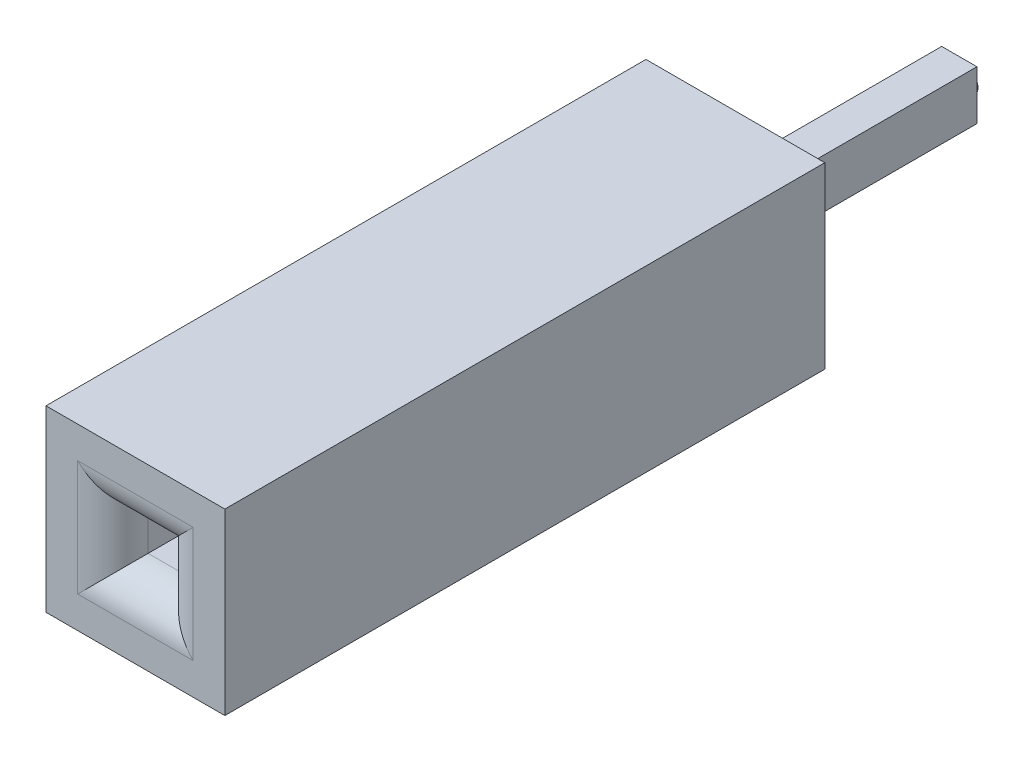
ISO-10303-21;
HEADER;
FILE_DESCRIPTION(('STEP AP214'),'2;1');
FILE_NAME('part.step','',(''),(''),'','','');
FILE_SCHEMA(('AUTOMOTIVE_DESIGN { 1 0 10303 214 1 1 1 1 }'));
ENDSEC;
DATA;
#1=APPLICATION_CONTEXT('core data for automotive mechanical design processes');
#2=APPLICATION_PROTOCOL_DEFINITION('international standard','automotive_design',2000,#1);
#3=PRODUCT_CONTEXT('',#1,'mechanical');
#4=PRODUCT('Part','Part','',(#3));
#5=PRODUCT_RELATED_PRODUCT_CATEGORY('part','',(#4));
#6=PRODUCT_DEFINITION_FORMATION('','',#4);
#7=PRODUCT_DEFINITION_CONTEXT('part definition',#1,'design');
#8=PRODUCT_DEFINITION('design','',#6,#7);
#9=PRODUCT_DEFINITION_SHAPE('','',#8);
#10=(LENGTH_UNIT() NAMED_UNIT(*) SI_UNIT(.MILLI.,.METRE.));
#11=(NAMED_UNIT(*) PLANE_ANGLE_UNIT() SI_UNIT($,.RADIAN.));
#12=(NAMED_UNIT(*) SI_UNIT($,.STERADIAN.) SOLID_ANGLE_UNIT());
#13=UNCERTAINTY_MEASURE_WITH_UNIT(LENGTH_MEASURE(1.E-05),#10,'distance_accuracy_value','');
#14=(GEOMETRIC_REPRESENTATION_CONTEXT(3) GLOBAL_UNCERTAINTY_ASSIGNED_CONTEXT((#13)) GLOBAL_UNIT_ASSIGNED_CONTEXT((#10,
#11,#12)) REPRESENTATION_CONTEXT('',''));
#15=CARTESIAN_POINT('',(0.,0.,0.));
#16=DIRECTION('',(0.,0.,1.));
#17=DIRECTION('',(1.,0.,0.));
#18=AXIS2_PLACEMENT_3D('',#15,#16,#17);
#19=CARTESIAN_POINT('',(-0.25,-0.35,-3.18));
#20=DIRECTION('',(0.,0.,-1.));
#21=DIRECTION('',(0.,1.,0.));
#22=AXIS2_PLACEMENT_3D('',#19,#20,#21);
#23=PLANE('',#22);
#24=DIRECTION('',(0.,1.,0.));
#25=VECTOR('',#24,1.);
#26=CARTESIAN_POINT('',(-0.25,0.35,-3.18));
#27=LINE('',#26,#25);
#28=CARTESIAN_POINT('',(-0.25,-0.35,-3.18));
#29=VERTEX_POINT('',#28);
#30=CARTESIAN_POINT('',(-0.25,0.35,-3.18));
#31=VERTEX_POINT('',#30);
#32=EDGE_CURVE('E146',#29,#31,#27,.T.);
#33=ORIENTED_EDGE('',*,*,#32,.T.);
#34=DIRECTION('',(1.,0.,0.));
#35=VECTOR('',#34,1.);
#36=CARTESIAN_POINT('',(0.25,0.35,-3.18));
#37=LINE('',#36,#35);
#38=CARTESIAN_POINT('',(0.25,0.35,-3.18));
#39=VERTEX_POINT('',#38);
#40=EDGE_CURVE('E135',#31,#39,#37,.T.);
#41=ORIENTED_EDGE('',*,*,#40,.T.);
#42=DIRECTION('',(0.,-1.,0.));
#43=VECTOR('',#42,1.);
#44=CARTESIAN_POINT('',(0.25,0.35,-3.18));
#45=LINE('',#44,#43);
#46=CARTESIAN_POINT('',(0.25,-0.35,-3.18));
#47=VERTEX_POINT('',#46);
#48=EDGE_CURVE('E145',#39,#47,#45,.T.);
#49=ORIENTED_EDGE('',*,*,#48,.T.);
#50=DIRECTION('',(-1.,0.,0.));
#51=VECTOR('',#50,1.);
#52=CARTESIAN_POINT('',(0.25,-0.35,-3.18));
#53=LINE('',#52,#51);
#54=EDGE_CURVE('E150',#47,#29,#53,.T.);
#55=ORIENTED_EDGE('',*,*,#54,.T.);
#56=EDGE_LOOP('',(#33,#41,#49,#55));
#57=FACE_BOUND('',#56,.T.);
#58=CARTESIAN_POINT('',(0.,0.,-3.18));
#59=DIRECTION('',(0.,0.,-1.));
#60=DIRECTION('',(0.,1.,0.));
#61=AXIS2_PLACEMENT_3D('',#58,#59,#60);
#62=CIRCLE('',#61,0.165430125999977);
#63=CARTESIAN_POINT('',(0.,0.165430125999976,-3.18));
#64=VERTEX_POINT('',#63);
#65=EDGE_CURVE('E396',#64,#64,#62,.T.);
#66=ORIENTED_EDGE('',*,*,#65,.F.);
#67=EDGE_LOOP('',(#66));
#68=FACE_BOUND('',#67,.T.);
#69=ADVANCED_FACE('F33',(#57,#68),#23,.T.);
#70=CARTESIAN_POINT('',(1.27,1.27,0.));
#71=DIRECTION('',(0.,0.,-1.));
#72=DIRECTION('',(-1.,0.,0.));
#73=AXIS2_PLACEMENT_3D('',#70,#71,#72);
#74=PLANE('',#73);
#75=DIRECTION('',(0.,1.,0.));
#76=VECTOR('',#75,1.);
#77=CARTESIAN_POINT('',(1.27,-1.27,0.));
#78=LINE('',#77,#76);
#79=CARTESIAN_POINT('',(1.27,-1.27,0.));
#80=VERTEX_POINT('',#79);
#81=CARTESIAN_POINT('',(1.27,1.27,0.));
#82=VERTEX_POINT('',#81);
#83=EDGE_CURVE('E183',#80,#82,#78,.T.);
#84=ORIENTED_EDGE('',*,*,#83,.F.);
#85=DIRECTION('',(1.,0.,0.));
#86=VECTOR('',#85,1.);
#87=CARTESIAN_POINT('',(-1.27,-1.27,0.));
#88=LINE('',#87,#86);
#89=CARTESIAN_POINT('',(-1.27,-1.27,0.));
#90=VERTEX_POINT('',#89);
#91=EDGE_CURVE('E194',#90,#80,#88,.T.);
#92=ORIENTED_EDGE('',*,*,#91,.F.);
#93=DIRECTION('',(0.,-1.,0.));
#94=VECTOR('',#93,1.);
#95=CARTESIAN_POINT('',(-1.27,-1.27,0.));
#96=LINE('',#95,#94);
#97=CARTESIAN_POINT('',(-1.27,1.27,0.));
#98=VERTEX_POINT('',#97);
#99=EDGE_CURVE('E205',#98,#90,#96,.T.);
#100=ORIENTED_EDGE('',*,*,#99,.F.);
#101=DIRECTION('',(-1.,0.,0.));
#102=VECTOR('',#101,1.);
#103=CARTESIAN_POINT('',(-1.27,1.27,0.));
#104=LINE('',#103,#102);
#105=EDGE_CURVE('E203',#82,#98,#104,.T.);
#106=ORIENTED_EDGE('',*,*,#105,.F.);
#107=EDGE_LOOP('',(#84,#92,#100,#106));
#108=FACE_BOUND('',#107,.T.);
#109=DIRECTION('',(1.,0.,0.));
#110=VECTOR('',#109,1.);
#111=CARTESIAN_POINT('',(0.25,0.35,0.));
#112=LINE('',#111,#110);
#113=CARTESIAN_POINT('',(-0.25,0.35,0.));
#114=VERTEX_POINT('',#113);
#115=CARTESIAN_POINT('',(0.25,0.35,0.));
#116=VERTEX_POINT('',#115);
#117=EDGE_CURVE('E410',#114,#116,#112,.T.);
#118=ORIENTED_EDGE('',*,*,#117,.F.);
#119=DIRECTION('',(0.,1.,0.));
#120=VECTOR('',#119,1.);
#121=CARTESIAN_POINT('',(-0.25,0.35,0.));
#122=LINE('',#121,#120);
#123=CARTESIAN_POINT('',(-0.25,-0.35,0.));
#124=VERTEX_POINT('',#123);
#125=EDGE_CURVE('E158',#124,#114,#122,.T.);
#126=ORIENTED_EDGE('',*,*,#125,.F.);
#127=DIRECTION('',(-1.,0.,0.));
#128=VECTOR('',#127,1.);
#129=CARTESIAN_POINT('',(0.25,-0.35,0.));
#130=LINE('',#129,#128);
#131=CARTESIAN_POINT('',(0.25,-0.35,0.));
#132=VERTEX_POINT('',#131);
#133=EDGE_CURVE('E154',#132,#124,#130,.T.);
#134=ORIENTED_EDGE('',*,*,#133,.F.);
#135=DIRECTION('',(0.,-1.,0.));
#136=VECTOR('',#135,1.);
#137=CARTESIAN_POINT('',(0.25,0.35,0.));
#138=LINE('',#137,#136);
#139=EDGE_CURVE('E412',#116,#132,#138,.T.);
#140=ORIENTED_EDGE('',*,*,#139,.F.);
#141=EDGE_LOOP('',(#118,#126,#134,#140));
#142=FACE_BOUND('',#141,.T.);
#143=ADVANCED_FACE('F282',(#108,#142),#74,.T.);
#144=CARTESIAN_POINT('',(1.27,-1.27,8.52));
#145=DIRECTION('',(-1.,0.,0.));
#146=DIRECTION('',(0.,0.,1.));
#147=AXIS2_PLACEMENT_3D('',#144,#145,#146);
#148=PLANE('',#147);
#149=ORIENTED_EDGE('',*,*,#83,.T.);
#150=DIRECTION('',(0.,0.,-1.));
#151=VECTOR('',#150,1.);
#152=CARTESIAN_POINT('',(1.27,1.27,8.52));
#153=LINE('',#152,#151);
#154=CARTESIAN_POINT('',(1.27,1.27,8.52));
#155=VERTEX_POINT('',#154);
#156=EDGE_CURVE('E216',#155,#82,#153,.T.);
#157=ORIENTED_EDGE('',*,*,#156,.F.);
#158=DIRECTION('',(0.,1.,0.));
#159=VECTOR('',#158,1.);
#160=CARTESIAN_POINT('',(1.27,-1.27,8.52));
#161=LINE('',#160,#159);
#162=CARTESIAN_POINT('',(1.27,-1.27,8.52));
#163=VERTEX_POINT('',#162);
#164=EDGE_CURVE('E190',#163,#155,#161,.T.);
#165=ORIENTED_EDGE('',*,*,#164,.F.);
#166=DIRECTION('',(0.,0.,-1.));
#167=VECTOR('',#166,1.);
#168=CARTESIAN_POINT('',(1.27,-1.27,8.52));
#169=LINE('',#168,#167);
#170=EDGE_CURVE('E200',#163,#80,#169,.T.);
#171=ORIENTED_EDGE('',*,*,#170,.T.);
#172=EDGE_LOOP('',(#149,#157,#165,#171));
#173=FACE_BOUND('',#172,.T.);
#174=ADVANCED_FACE('F289',(#173),#148,.F.);
#175=CARTESIAN_POINT('',(-1.27,1.27,8.52));
#176=DIRECTION('',(0.,-1.,0.));
#177=DIRECTION('',(0.,0.,-1.));
#178=AXIS2_PLACEMENT_3D('',#175,#176,#177);
#179=PLANE('',#178);
#180=ORIENTED_EDGE('',*,*,#105,.T.);
#181=DIRECTION('',(0.,0.,-1.));
#182=VECTOR('',#181,1.);
#183=CARTESIAN_POINT('',(-1.27,1.27,8.52));
#184=LINE('',#183,#182);
#185=CARTESIAN_POINT('',(-1.27,1.27,8.52));
#186=VERTEX_POINT('',#185);
#187=EDGE_CURVE('E213',#186,#98,#184,.T.);
#188=ORIENTED_EDGE('',*,*,#187,.F.);
#189=DIRECTION('',(-1.,0.,0.));
#190=VECTOR('',#189,1.);
#191=CARTESIAN_POINT('',(-1.27,1.27,8.52));
#192=LINE('',#191,#190);
#193=EDGE_CURVE('E193',#155,#186,#192,.T.);
#194=ORIENTED_EDGE('',*,*,#193,.F.);
#195=ORIENTED_EDGE('',*,*,#156,.T.);
#196=EDGE_LOOP('',(#180,#188,#194,#195));
#197=FACE_BOUND('',#196,.T.);
#198=ADVANCED_FACE('F323',(#197),#179,.F.);
#199=CARTESIAN_POINT('',(-1.27,-1.27,8.52));
#200=DIRECTION('',(1.,0.,0.));
#201=DIRECTION('',(0.,0.,-1.));
#202=AXIS2_PLACEMENT_3D('',#199,#200,#201);
#203=PLANE('',#202);
#204=ORIENTED_EDGE('',*,*,#99,.T.);
#205=DIRECTION('',(0.,0.,-1.));
#206=VECTOR('',#205,1.);
#207=CARTESIAN_POINT('',(-1.27,-1.27,8.52));
#208=LINE('',#207,#206);
#209=CARTESIAN_POINT('',(-1.27,-1.27,8.52));
#210=VERTEX_POINT('',#209);
#211=EDGE_CURVE('E210',#210,#90,#208,.T.);
#212=ORIENTED_EDGE('',*,*,#211,.F.);
#213=DIRECTION('',(0.,-1.,0.));
#214=VECTOR('',#213,1.);
#215=CARTESIAN_POINT('',(-1.27,-1.27,8.52));
#216=LINE('',#215,#214);
#217=EDGE_CURVE('E196',#186,#210,#216,.T.);
#218=ORIENTED_EDGE('',*,*,#217,.F.);
#219=ORIENTED_EDGE('',*,*,#187,.T.);
#220=EDGE_LOOP('',(#204,#212,#218,#219));
#221=FACE_BOUND('',#220,.T.);
#222=ADVANCED_FACE('F319',(#221),#203,.F.);
#223=CARTESIAN_POINT('',(-1.27,-1.27,8.52));
#224=DIRECTION('',(0.,1.,0.));
#225=DIRECTION('',(0.,0.,1.));
#226=AXIS2_PLACEMENT_3D('',#223,#224,#225);
#227=PLANE('',#226);
#228=ORIENTED_EDGE('',*,*,#91,.T.);
#229=ORIENTED_EDGE('',*,*,#170,.F.);
#230=DIRECTION('',(1.,0.,0.));
#231=VECTOR('',#230,1.);
#232=CARTESIAN_POINT('',(-1.27,-1.27,8.52));
#233=LINE('',#232,#231);
#234=EDGE_CURVE('E198',#210,#163,#233,.T.);
#235=ORIENTED_EDGE('',*,*,#234,.F.);
#236=ORIENTED_EDGE('',*,*,#211,.T.);
#237=EDGE_LOOP('',(#228,#229,#235,#236));
#238=FACE_BOUND('',#237,.T.);
#239=ADVANCED_FACE('F314',(#238),#227,.F.);
#240=CARTESIAN_POINT('',(1.27,1.27,8.52));
#241=DIRECTION('',(0.,0.,-1.));
#242=DIRECTION('',(-1.,0.,0.));
#243=AXIS2_PLACEMENT_3D('',#240,#241,#242);
#244=PLANE('',#243);
#245=DIRECTION('',(0.,1.,0.));
#246=VECTOR('',#245,1.);
#247=CARTESIAN_POINT('',(0.82,1.27,8.52));
#248=LINE('',#247,#246);
#249=CARTESIAN_POINT('',(0.82,0.82,8.52));
#250=VERTEX_POINT('',#249);
#251=CARTESIAN_POINT('',(0.82,-0.820000000000001,8.52));
#252=VERTEX_POINT('',#251);
#253=EDGE_CURVE('E226',#250,#252,#248,.F.);
#254=ORIENTED_EDGE('',*,*,#253,.T.);
#255=DIRECTION('',(1.,0.,0.));
#256=VECTOR('',#255,1.);
#257=CARTESIAN_POINT('',(1.27,-0.82,8.52));
#258=LINE('',#257,#256);
#259=CARTESIAN_POINT('',(-0.82,-0.820000000000001,8.52));
#260=VERTEX_POINT('',#259);
#261=EDGE_CURVE('E228',#252,#260,#258,.F.);
#262=ORIENTED_EDGE('',*,*,#261,.T.);
#263=DIRECTION('',(0.,-1.,0.));
#264=VECTOR('',#263,1.);
#265=CARTESIAN_POINT('',(-0.82,1.27,8.52));
#266=LINE('',#265,#264);
#267=CARTESIAN_POINT('',(-0.82,0.82,8.52));
#268=VERTEX_POINT('',#267);
#269=EDGE_CURVE('E222',#260,#268,#266,.F.);
#270=ORIENTED_EDGE('',*,*,#269,.T.);
#271=DIRECTION('',(-1.,0.,0.));
#272=VECTOR('',#271,1.);
#273=CARTESIAN_POINT('',(1.27,0.82,8.52));
#274=LINE('',#273,#272);
#275=EDGE_CURVE('E224',#268,#250,#274,.F.);
#276=ORIENTED_EDGE('',*,*,#275,.T.);
#277=EDGE_LOOP('',(#254,#262,#270,#276));
#278=FACE_BOUND('',#277,.T.);
#279=ORIENTED_EDGE('',*,*,#164,.T.);
#280=ORIENTED_EDGE('',*,*,#193,.T.);
#281=ORIENTED_EDGE('',*,*,#217,.T.);
#282=ORIENTED_EDGE('',*,*,#234,.T.);
#283=EDGE_LOOP('',(#279,#280,#281,#282));
#284=FACE_BOUND('',#283,.T.);
#285=ADVANCED_FACE('F250',(#278,#284),#244,.F.);
#286=CARTESIAN_POINT('',(0.32,-0.320000000000001,2.02));
#287=DIRECTION('',(1.,0.,0.));
#288=DIRECTION('',(0.,0.,-1.));
#289=AXIS2_PLACEMENT_3D('',#286,#287,#288);
#290=PLANE('',#289);
#291=DIRECTION('',(0.,0.,1.));
#292=VECTOR('',#291,1.);
#293=CARTESIAN_POINT('',(0.32,-0.320000000000001,2.02));
#294=LINE('',#293,#292);
#295=CARTESIAN_POINT('',(0.32,-0.320000000000001,2.02));
#296=VERTEX_POINT('',#295);
#297=CARTESIAN_POINT('',(0.32,-0.320000000000001,8.02));
#298=VERTEX_POINT('',#297);
#299=EDGE_CURVE('E180',#296,#298,#294,.T.);
#300=ORIENTED_EDGE('',*,*,#299,.T.);
#301=DIRECTION('',(0.,1.,0.));
#302=VECTOR('',#301,1.);
#303=CARTESIAN_POINT('',(0.32,-0.320000000000001,8.02));
#304=LINE('',#303,#302);
#305=CARTESIAN_POINT('',(0.32,0.32,8.02));
#306=VERTEX_POINT('',#305);
#307=EDGE_CURVE('E231',#298,#306,#304,.T.);
#308=ORIENTED_EDGE('',*,*,#307,.T.);
#309=DIRECTION('',(0.,0.,1.));
#310=VECTOR('',#309,1.);
#311=CARTESIAN_POINT('',(0.32,0.32,2.02));
#312=LINE('',#311,#310);
#313=CARTESIAN_POINT('',(0.32,0.32,2.02));
#314=VERTEX_POINT('',#313);
#315=EDGE_CURVE('E179',#314,#306,#312,.T.);
#316=ORIENTED_EDGE('',*,*,#315,.F.);
#317=DIRECTION('',(0.,1.,0.));
#318=VECTOR('',#317,1.);
#319=CARTESIAN_POINT('',(0.32,-0.320000000000001,2.02));
#320=LINE('',#319,#318);
#321=EDGE_CURVE('E167',#296,#314,#320,.T.);
#322=ORIENTED_EDGE('',*,*,#321,.F.);
#323=EDGE_LOOP('',(#300,#308,#316,#322));
#324=FACE_BOUND('',#323,.T.);
#325=ADVANCED_FACE('F263',(#324),#290,.F.);
#326=CARTESIAN_POINT('',(-0.32,-0.320000000000001,2.02));
#327=DIRECTION('',(0.,-1.,0.));
#328=DIRECTION('',(0.,0.,-1.));
#329=AXIS2_PLACEMENT_3D('',#326,#327,#328);
#330=PLANE('',#329);
#331=DIRECTION('',(0.,0.,1.));
#332=VECTOR('',#331,1.);
#333=CARTESIAN_POINT('',(-0.32,-0.320000000000001,2.02));
#334=LINE('',#333,#332);
#335=CARTESIAN_POINT('',(-0.32,-0.320000000000001,2.02));
#336=VERTEX_POINT('',#335);
#337=CARTESIAN_POINT('',(-0.32,-0.320000000000001,8.02));
#338=VERTEX_POINT('',#337);
#339=EDGE_CURVE('E184',#336,#338,#334,.T.);
#340=ORIENTED_EDGE('',*,*,#339,.T.);
#341=DIRECTION('',(1.,0.,0.));
#342=VECTOR('',#341,1.);
#343=CARTESIAN_POINT('',(-0.32,-0.320000000000001,8.02));
#344=LINE('',#343,#342);
#345=EDGE_CURVE('E219',#338,#298,#344,.T.);
#346=ORIENTED_EDGE('',*,*,#345,.T.);
#347=ORIENTED_EDGE('',*,*,#299,.F.);
#348=DIRECTION('',(1.,0.,0.));
#349=VECTOR('',#348,1.);
#350=CARTESIAN_POINT('',(-0.32,-0.320000000000001,2.02));
#351=LINE('',#350,#349);
#352=EDGE_CURVE('E176',#336,#296,#351,.T.);
#353=ORIENTED_EDGE('',*,*,#352,.F.);
#354=EDGE_LOOP('',(#340,#346,#347,#353));
#355=FACE_BOUND('',#354,.T.);
#356=ADVANCED_FACE('F260',(#355),#330,.F.);
#357=CARTESIAN_POINT('',(-0.32,-0.320000000000001,2.02));
#358=DIRECTION('',(-1.,0.,0.));
#359=DIRECTION('',(0.,0.,1.));
#360=AXIS2_PLACEMENT_3D('',#357,#358,#359);
#361=PLANE('',#360);
#362=DIRECTION('',(0.,0.,1.));
#363=VECTOR('',#362,1.);
#364=CARTESIAN_POINT('',(-0.32,0.32,2.02));
#365=LINE('',#364,#363);
#366=CARTESIAN_POINT('',(-0.32,0.32,2.02));
#367=VERTEX_POINT('',#366);
#368=CARTESIAN_POINT('',(-0.32,0.32,8.02));
#369=VERTEX_POINT('',#368);
#370=EDGE_CURVE('E187',#367,#369,#365,.T.);
#371=ORIENTED_EDGE('',*,*,#370,.T.);
#372=DIRECTION('',(0.,-1.,0.));
#373=VECTOR('',#372,1.);
#374=CARTESIAN_POINT('',(-0.32,-0.320000000000001,8.02));
#375=LINE('',#374,#373);
#376=EDGE_CURVE('E11',#369,#338,#375,.T.);
#377=ORIENTED_EDGE('',*,*,#376,.T.);
#378=ORIENTED_EDGE('',*,*,#339,.F.);
#379=DIRECTION('',(0.,-1.,0.));
#380=VECTOR('',#379,1.);
#381=CARTESIAN_POINT('',(-0.32,-0.320000000000001,2.02));
#382=LINE('',#381,#380);
#383=EDGE_CURVE('E173',#367,#336,#382,.T.);
#384=ORIENTED_EDGE('',*,*,#383,.F.);
#385=EDGE_LOOP('',(#371,#377,#378,#384));
#386=FACE_BOUND('',#385,.T.);
#387=ADVANCED_FACE('F269',(#386),#361,.F.);
#388=CARTESIAN_POINT('',(-0.32,0.32,2.02));
#389=DIRECTION('',(0.,1.,0.));
#390=DIRECTION('',(0.,0.,1.));
#391=AXIS2_PLACEMENT_3D('',#388,#389,#390);
#392=PLANE('',#391);
#393=ORIENTED_EDGE('',*,*,#315,.T.);
#394=DIRECTION('',(-1.,0.,0.));
#395=VECTOR('',#394,1.);
#396=CARTESIAN_POINT('',(-0.32,0.32,8.02));
#397=LINE('',#396,#395);
#398=EDGE_CURVE('E42',#306,#369,#397,.T.);
#399=ORIENTED_EDGE('',*,*,#398,.T.);
#400=ORIENTED_EDGE('',*,*,#370,.F.);
#401=DIRECTION('',(-1.,0.,0.));
#402=VECTOR('',#401,1.);
#403=CARTESIAN_POINT('',(-0.32,0.32,2.02));
#404=LINE('',#403,#402);
#405=EDGE_CURVE('E170',#314,#367,#404,.T.);
#406=ORIENTED_EDGE('',*,*,#405,.F.);
#407=EDGE_LOOP('',(#393,#399,#400,#406));
#408=FACE_BOUND('',#407,.T.);
#409=ADVANCED_FACE('F270',(#408),#392,.F.);
#410=CARTESIAN_POINT('',(0.32,0.32,2.02));
#411=DIRECTION('',(0.,0.,-1.));
#412=DIRECTION('',(-1.,0.,0.));
#413=AXIS2_PLACEMENT_3D('',#410,#411,#412);
#414=PLANE('',#413);
#415=CARTESIAN_POINT('',(0.,0.,2.02));
#416=DIRECTION('',(0.,0.,1.));
#417=DIRECTION('',(1.,0.,0.));
#418=AXIS2_PLACEMENT_3D('',#415,#416,#417);
#419=CIRCLE('',#418,0.255);
#420=CARTESIAN_POINT('',(0.255,0.,2.02));
#421=VERTEX_POINT('',#420);
#422=EDGE_CURVE('E395',#421,#421,#419,.T.);
#423=ORIENTED_EDGE('',*,*,#422,.F.);
#424=EDGE_LOOP('',(#423));
#425=FACE_BOUND('',#424,.T.);
#426=ORIENTED_EDGE('',*,*,#321,.T.);
#427=ORIENTED_EDGE('',*,*,#405,.T.);
#428=ORIENTED_EDGE('',*,*,#383,.T.);
#429=ORIENTED_EDGE('',*,*,#352,.T.);
#430=EDGE_LOOP('',(#426,#427,#428,#429));
#431=FACE_BOUND('',#430,.T.);
#432=ADVANCED_FACE('F266',(#425,#431),#414,.F.);
#433=CARTESIAN_POINT('',(-0.32,0.82,8.02));
#434=DIRECTION('',(-1.,0.,0.));
#435=DIRECTION('',(0.,0.,1.));
#436=AXIS2_PLACEMENT_3D('',#433,#434,#435);
#437=CYLINDRICAL_SURFACE('',#436,0.5);
#438=CARTESIAN_POINT('',(0.82,0.82,8.02));
#439=DIRECTION('',(-0.707106781186547,0.707106781186547,0.));
#440=DIRECTION('',(0.707106781186547,0.707106781186547,0.));
#441=AXIS2_PLACEMENT_3D('',#438,#439,#440);
#442=ELLIPSE('',#441,0.707106781186547,0.5);
#443=EDGE_CURVE('E234',#250,#306,#442,.F.);
#444=ORIENTED_EDGE('',*,*,#443,.F.);
#445=ORIENTED_EDGE('',*,*,#275,.F.);
#446=CARTESIAN_POINT('',(-0.82,0.82,8.02));
#447=DIRECTION('',(-0.707106781186547,-0.707106781186547,0.));
#448=DIRECTION('',(-0.707106781186547,0.707106781186547,0.));
#449=AXIS2_PLACEMENT_3D('',#446,#447,#448);
#450=ELLIPSE('',#449,0.707106781186547,0.5);
#451=EDGE_CURVE('E37',#369,#268,#450,.T.);
#452=ORIENTED_EDGE('',*,*,#451,.F.);
#453=ORIENTED_EDGE('',*,*,#398,.F.);
#454=EDGE_LOOP('',(#444,#445,#452,#453));
#455=FACE_BOUND('',#454,.T.);
#456=ADVANCED_FACE('F35',(#455),#437,.T.);
#457=CARTESIAN_POINT('',(-0.82,-0.320000000000001,8.02));
#458=DIRECTION('',(0.,-1.,0.));
#459=DIRECTION('',(0.,0.,-1.));
#460=AXIS2_PLACEMENT_3D('',#457,#458,#459);
#461=CYLINDRICAL_SURFACE('',#460,0.5);
#462=ORIENTED_EDGE('',*,*,#451,.T.);
#463=ORIENTED_EDGE('',*,*,#269,.F.);
#464=CARTESIAN_POINT('',(-0.82,-0.820000000000001,8.02));
#465=DIRECTION('',(0.707106781186547,-0.707106781186547,0.));
#466=DIRECTION('',(0.707106781186547,0.707106781186547,0.));
#467=AXIS2_PLACEMENT_3D('',#464,#465,#466);
#468=ELLIPSE('',#467,0.707106781186547,0.5);
#469=EDGE_CURVE('E162',#338,#260,#468,.T.);
#470=ORIENTED_EDGE('',*,*,#469,.F.);
#471=ORIENTED_EDGE('',*,*,#376,.F.);
#472=EDGE_LOOP('',(#462,#463,#470,#471));
#473=FACE_BOUND('',#472,.T.);
#474=ADVANCED_FACE('F245',(#473),#461,.T.);
#475=CARTESIAN_POINT('',(0.82,-0.320000000000001,8.02));
#476=DIRECTION('',(0.,1.,0.));
#477=DIRECTION('',(0.,0.,1.));
#478=AXIS2_PLACEMENT_3D('',#475,#476,#477);
#479=CYLINDRICAL_SURFACE('',#478,0.5);
#480=ORIENTED_EDGE('',*,*,#443,.T.);
#481=ORIENTED_EDGE('',*,*,#307,.F.);
#482=CARTESIAN_POINT('',(0.82,-0.820000000000001,8.02));
#483=DIRECTION('',(0.707106781186547,0.707106781186547,0.));
#484=DIRECTION('',(0.707106781186547,-0.707106781186547,0.));
#485=AXIS2_PLACEMENT_3D('',#482,#483,#484);
#486=ELLIPSE('',#485,0.707106781186547,0.5);
#487=EDGE_CURVE('E160',#252,#298,#486,.F.);
#488=ORIENTED_EDGE('',*,*,#487,.F.);
#489=ORIENTED_EDGE('',*,*,#253,.F.);
#490=EDGE_LOOP('',(#480,#481,#488,#489));
#491=FACE_BOUND('',#490,.T.);
#492=ADVANCED_FACE('F257',(#491),#479,.T.);
#493=CARTESIAN_POINT('',(-0.32,-0.820000000000001,8.02));
#494=DIRECTION('',(1.,0.,0.));
#495=DIRECTION('',(0.,0.,-1.));
#496=AXIS2_PLACEMENT_3D('',#493,#494,#495);
#497=CYLINDRICAL_SURFACE('',#496,0.5);
#498=ORIENTED_EDGE('',*,*,#469,.T.);
#499=ORIENTED_EDGE('',*,*,#261,.F.);
#500=ORIENTED_EDGE('',*,*,#487,.T.);
#501=ORIENTED_EDGE('',*,*,#345,.F.);
#502=EDGE_LOOP('',(#498,#499,#500,#501));
#503=FACE_BOUND('',#502,.T.);
#504=ADVANCED_FACE('F255',(#503),#497,.T.);
#505=CARTESIAN_POINT('',(-0.25,0.35,-3.18));
#506=DIRECTION('',(1.,0.,0.));
#507=DIRECTION('',(0.,0.,-1.));
#508=AXIS2_PLACEMENT_3D('',#505,#506,#507);
#509=PLANE('',#508);
#510=ORIENTED_EDGE('',*,*,#125,.T.);
#511=DIRECTION('',(0.,0.,1.));
#512=VECTOR('',#511,1.);
#513=CARTESIAN_POINT('',(-0.25,0.35,-3.18));
#514=LINE('',#513,#512);
#515=EDGE_CURVE('E139',#31,#114,#514,.T.);
#516=ORIENTED_EDGE('',*,*,#515,.F.);
#517=ORIENTED_EDGE('',*,*,#32,.F.);
#518=DIRECTION('',(0.,0.,1.));
#519=VECTOR('',#518,1.);
#520=CARTESIAN_POINT('',(-0.25,-0.35,-3.18));
#521=LINE('',#520,#519);
#522=EDGE_CURVE('E408',#29,#124,#521,.T.);
#523=ORIENTED_EDGE('',*,*,#522,.T.);
#524=EDGE_LOOP('',(#510,#516,#517,#523));
#525=FACE_BOUND('',#524,.T.);
#526=ADVANCED_FACE('F156',(#525),#509,.F.);
#527=CARTESIAN_POINT('',(0.25,0.35,-3.18));
#528=DIRECTION('',(0.,-1.,0.));
#529=DIRECTION('',(1.,0.,0.));
#530=AXIS2_PLACEMENT_3D('',#527,#528,#529);
#531=PLANE('',#530);
#532=ORIENTED_EDGE('',*,*,#117,.T.);
#533=DIRECTION('',(0.,0.,1.));
#534=VECTOR('',#533,1.);
#535=CARTESIAN_POINT('',(0.25,0.35,-3.18));
#536=LINE('',#535,#534);
#537=EDGE_CURVE('E142',#39,#116,#536,.T.);
#538=ORIENTED_EDGE('',*,*,#537,.F.);
#539=ORIENTED_EDGE('',*,*,#40,.F.);
#540=ORIENTED_EDGE('',*,*,#515,.T.);
#541=EDGE_LOOP('',(#532,#538,#539,#540));
#542=FACE_BOUND('',#541,.T.);
#543=ADVANCED_FACE('F137',(#542),#531,.F.);
#544=CARTESIAN_POINT('',(0.25,0.35,-3.18));
#545=DIRECTION('',(-1.,0.,0.));
#546=DIRECTION('',(0.,0.,1.));
#547=AXIS2_PLACEMENT_3D('',#544,#545,#546);
#548=PLANE('',#547);
#549=ORIENTED_EDGE('',*,*,#139,.T.);
#550=DIRECTION('',(0.,0.,1.));
#551=VECTOR('',#550,1.);
#552=CARTESIAN_POINT('',(0.25,-0.35,-3.18));
#553=LINE('',#552,#551);
#554=EDGE_CURVE('E50',#47,#132,#553,.T.);
#555=ORIENTED_EDGE('',*,*,#554,.F.);
#556=ORIENTED_EDGE('',*,*,#48,.F.);
#557=ORIENTED_EDGE('',*,*,#537,.T.);
#558=EDGE_LOOP('',(#549,#555,#556,#557));
#559=FACE_BOUND('',#558,.T.);
#560=ADVANCED_FACE('F299',(#559),#548,.F.);
#561=CARTESIAN_POINT('',(0.25,-0.35,-3.18));
#562=DIRECTION('',(0.,1.,0.));
#563=DIRECTION('',(-1.,0.,0.));
#564=AXIS2_PLACEMENT_3D('',#561,#562,#563);
#565=PLANE('',#564);
#566=ORIENTED_EDGE('',*,*,#133,.T.);
#567=ORIENTED_EDGE('',*,*,#522,.F.);
#568=ORIENTED_EDGE('',*,*,#54,.F.);
#569=ORIENTED_EDGE('',*,*,#554,.T.);
#570=EDGE_LOOP('',(#566,#567,#568,#569));
#571=FACE_BOUND('',#570,.T.);
#572=ADVANCED_FACE('F296',(#571),#565,.F.);
#573=CARTESIAN_POINT('',(0.,0.,1.76));
#574=DIRECTION('',(0.,0.,1.));
#575=DIRECTION('',(1.,0.,0.));
#576=AXIS2_PLACEMENT_3D('',#573,#574,#575);
#577=CYLINDRICAL_SURFACE('',#576,0.255);
#578=CARTESIAN_POINT('',(0.,0.,1.76));
#579=DIRECTION('',(0.,0.,1.));
#580=DIRECTION('',(1.,0.,0.));
#581=AXIS2_PLACEMENT_3D('',#578,#579,#580);
#582=CIRCLE('',#581,0.255);
#583=CARTESIAN_POINT('',(0.255,0.,1.76));
#584=VERTEX_POINT('',#583);
#585=EDGE_CURVE('E399',#584,#584,#582,.T.);
#586=ORIENTED_EDGE('',*,*,#585,.F.);
#587=EDGE_LOOP('',(#586));
#588=FACE_BOUND('',#587,.T.);
#589=ORIENTED_EDGE('',*,*,#422,.T.);
#590=EDGE_LOOP('',(#589));
#591=FACE_BOUND('',#590,.T.);
#592=ADVANCED_FACE('F294',(#588,#591),#577,.F.);
#593=CARTESIAN_POINT('',(0.,0.,1.76));
#594=DIRECTION('',(0.,0.,1.));
#595=DIRECTION('',(1.,0.,0.));
#596=AXIS2_PLACEMENT_3D('',#593,#594,#595);
#597=PLANE('',#596);
#598=ORIENTED_EDGE('',*,*,#585,.T.);
#599=EDGE_LOOP('',(#598));
#600=FACE_BOUND('',#599,.T.);
#601=ADVANCED_FACE('F357',(#600),#597,.T.);
#602=CARTESIAN_POINT('',(0.,0.,-3.28));
#603=DIRECTION('',(0.,0.,1.));
#604=DIRECTION('',(0.,-1.,0.));
#605=AXIS2_PLACEMENT_3D('',#602,#603,#604);
#606=CYLINDRICAL_SURFACE('',#605,0.165430125999977);
#607=CARTESIAN_POINT('',(0.,0.,-3.28));
#608=DIRECTION('',(0.,0.,-1.));
#609=DIRECTION('',(0.,1.,0.));
#610=AXIS2_PLACEMENT_3D('',#607,#608,#609);
#611=CIRCLE('',#610,0.165430125999977);
#612=CARTESIAN_POINT('',(0.,0.165430125999976,-3.28));
#613=VERTEX_POINT('',#612);
#614=EDGE_CURVE('E394',#613,#613,#611,.T.);
#615=ORIENTED_EDGE('',*,*,#614,.F.);
#616=EDGE_LOOP('',(#615));
#617=FACE_BOUND('',#616,.T.);
#618=ORIENTED_EDGE('',*,*,#65,.T.);
#619=EDGE_LOOP('',(#618));
#620=FACE_BOUND('',#619,.T.);
#621=ADVANCED_FACE('F365',(#617,#620),#606,.T.);
#622=CARTESIAN_POINT('',(0.,0.,-3.28));
#623=DIRECTION('',(0.,0.,-1.));
#624=DIRECTION('',(0.,1.,0.));
#625=AXIS2_PLACEMENT_3D('',#622,#623,#624);
#626=PLANE('',#625);
#627=ORIENTED_EDGE('',*,*,#614,.T.);
#628=EDGE_LOOP('',(#627));
#629=FACE_BOUND('',#628,.T.);
#630=ADVANCED_FACE('F378',(#629),#626,.T.);
#631=CLOSED_SHELL('',(#69,#143,#174,#198,#222,#239,#285,#325,#356,#387,#409,#432,#456,#474,#492,
#504,#526,#543,#560,#572,#592,#601,#621,#630));
#632=MANIFOLD_SOLID_BREP('B2',#631);
#633=ADVANCED_BREP_SHAPE_REPRESENTATION('',(#18,#632),#14);
#634=SHAPE_DEFINITION_REPRESENTATION(#9,#633);
ENDSEC;
END-ISO-10303-21;
